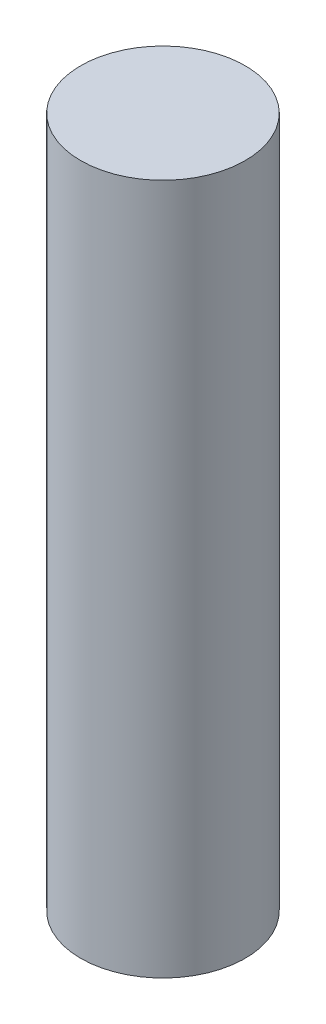
ISO-10303-21;
HEADER;
FILE_DESCRIPTION(('STEP AP214'),'2;1');
FILE_NAME('part.step','',(''),(''),'','','');
FILE_SCHEMA(('AUTOMOTIVE_DESIGN { 1 0 10303 214 1 1 1 1 }'));
ENDSEC;
DATA;
#1=APPLICATION_CONTEXT('core data for automotive mechanical design processes');
#2=APPLICATION_PROTOCOL_DEFINITION('international standard','automotive_design',2000,#1);
#3=PRODUCT_CONTEXT('',#1,'mechanical');
#4=PRODUCT('Part','Part','',(#3));
#5=PRODUCT_RELATED_PRODUCT_CATEGORY('part','',(#4));
#6=PRODUCT_DEFINITION_FORMATION('','',#4);
#7=PRODUCT_DEFINITION_CONTEXT('part definition',#1,'design');
#8=PRODUCT_DEFINITION('design','',#6,#7);
#9=PRODUCT_DEFINITION_SHAPE('','',#8);
#10=(LENGTH_UNIT() NAMED_UNIT(*) SI_UNIT(.MILLI.,.METRE.));
#11=(NAMED_UNIT(*) PLANE_ANGLE_UNIT() SI_UNIT($,.RADIAN.));
#12=(NAMED_UNIT(*) SI_UNIT($,.STERADIAN.) SOLID_ANGLE_UNIT());
#13=UNCERTAINTY_MEASURE_WITH_UNIT(LENGTH_MEASURE(1.E-05),#10,'distance_accuracy_value','');
#14=(GEOMETRIC_REPRESENTATION_CONTEXT(3) GLOBAL_UNCERTAINTY_ASSIGNED_CONTEXT((#13)) GLOBAL_UNIT_ASSIGNED_CONTEXT((#10,
#11,#12)) REPRESENTATION_CONTEXT('',''));
#15=CARTESIAN_POINT('',(0.,0.,0.));
#16=DIRECTION('',(0.,0.,1.));
#17=DIRECTION('',(1.,0.,0.));
#18=AXIS2_PLACEMENT_3D('',#15,#16,#17);
#19=CARTESIAN_POINT('',(0.,10.5,0.));
#20=DIRECTION('',(0.,-1.,0.));
#21=DIRECTION('',(0.,0.,-1.));
#22=AXIS2_PLACEMENT_3D('',#19,#20,#21);
#23=CYLINDRICAL_SURFACE('',#22,1.25);
#24=CARTESIAN_POINT('',(0.,10.5,0.));
#25=DIRECTION('',(0.,1.,0.));
#26=DIRECTION('',(0.,0.,1.));
#27=AXIS2_PLACEMENT_3D('',#24,#25,#26);
#28=CIRCLE('',#27,1.25);
#29=CARTESIAN_POINT('',(0.,10.5,1.25));
#30=VERTEX_POINT('',#29);
#31=EDGE_CURVE('E10',#30,#30,#28,.T.);
#32=ORIENTED_EDGE('',*,*,#31,.F.);
#33=EDGE_LOOP('',(#32));
#34=FACE_BOUND('',#33,.T.);
#35=CARTESIAN_POINT('',(0.,0.,0.));
#36=DIRECTION('',(0.,1.,0.));
#37=DIRECTION('',(0.,0.,1.));
#38=AXIS2_PLACEMENT_3D('',#35,#36,#37);
#39=CIRCLE('',#38,1.25);
#40=CARTESIAN_POINT('',(0.,0.,1.25));
#41=VERTEX_POINT('',#40);
#42=EDGE_CURVE('E44',#41,#41,#39,.T.);
#43=ORIENTED_EDGE('',*,*,#42,.T.);
#44=EDGE_LOOP('',(#43));
#45=FACE_BOUND('',#44,.T.);
#46=ADVANCED_FACE('F41',(#34,#45),#23,.T.);
#47=CARTESIAN_POINT('',(0.,10.5,0.));
#48=DIRECTION('',(0.,1.,0.));
#49=DIRECTION('',(0.,0.,1.));
#50=AXIS2_PLACEMENT_3D('',#47,#48,#49);
#51=PLANE('',#50);
#52=ORIENTED_EDGE('',*,*,#31,.T.);
#53=EDGE_LOOP('',(#52));
#54=FACE_BOUND('',#53,.T.);
#55=ADVANCED_FACE('F58',(#54),#51,.T.);
#56=CARTESIAN_POINT('',(0.,0.,0.));
#57=DIRECTION('',(0.,1.,0.));
#58=DIRECTION('',(0.,0.,1.));
#59=AXIS2_PLACEMENT_3D('',#56,#57,#58);
#60=PLANE('',#59);
#61=ORIENTED_EDGE('',*,*,#42,.F.);
#62=EDGE_LOOP('',(#61));
#63=FACE_BOUND('',#62,.T.);
#64=ADVANCED_FACE('F56',(#63),#60,.F.);
#65=CLOSED_SHELL('',(#46,#55,#64));
#66=MANIFOLD_SOLID_BREP('B2',#65);
#67=ADVANCED_BREP_SHAPE_REPRESENTATION('',(#18,#66),#14);
#68=SHAPE_DEFINITION_REPRESENTATION(#9,#67);
ENDSEC;
END-ISO-10303-21;
